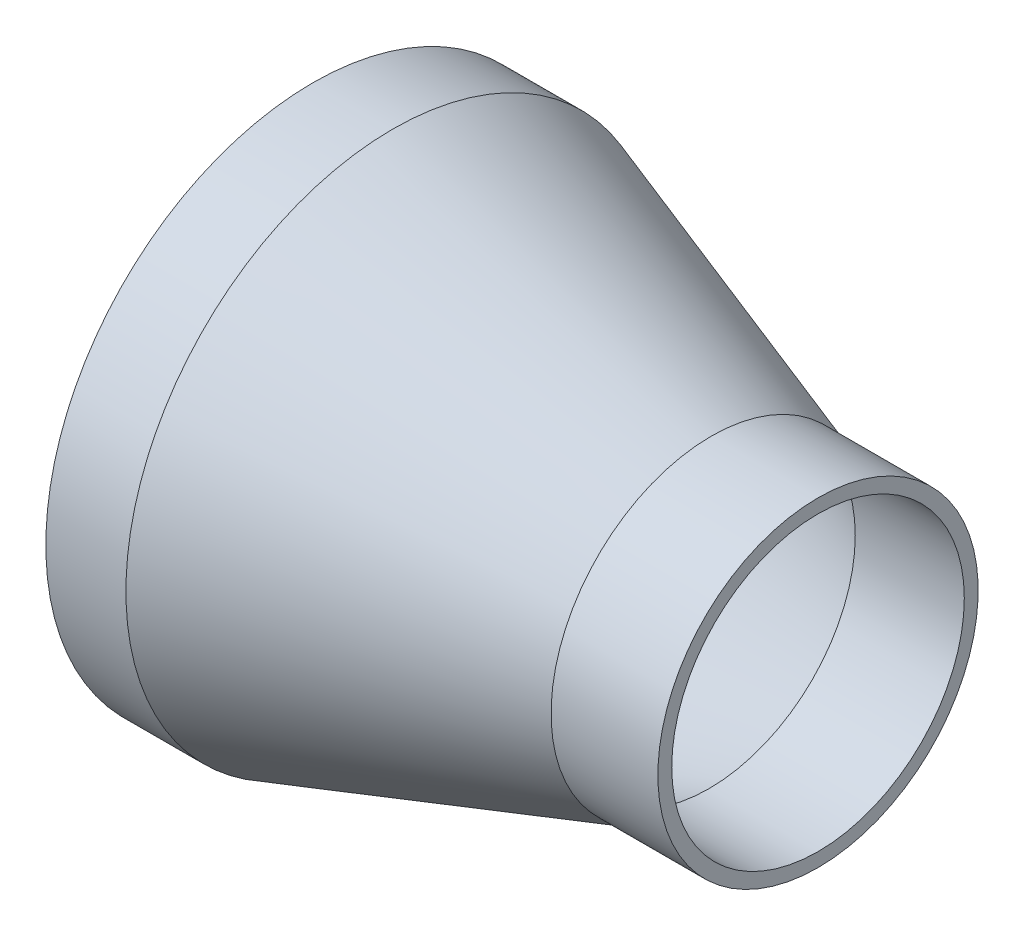
ISO-10303-21;
HEADER;
FILE_DESCRIPTION(('STEP AP214'),'2;1');
FILE_NAME('part.step','',(''),(''),'','','');
FILE_SCHEMA(('AUTOMOTIVE_DESIGN { 1 0 10303 214 1 1 1 1 }'));
ENDSEC;
DATA;
#1=APPLICATION_CONTEXT('core data for automotive mechanical design processes');
#2=APPLICATION_PROTOCOL_DEFINITION('international standard','automotive_design',2000,#1);
#3=PRODUCT_CONTEXT('',#1,'mechanical');
#4=PRODUCT('Part','Part','',(#3));
#5=PRODUCT_RELATED_PRODUCT_CATEGORY('part','',(#4));
#6=PRODUCT_DEFINITION_FORMATION('','',#4);
#7=PRODUCT_DEFINITION_CONTEXT('part definition',#1,'design');
#8=PRODUCT_DEFINITION('design','',#6,#7);
#9=PRODUCT_DEFINITION_SHAPE('','',#8);
#10=(LENGTH_UNIT() NAMED_UNIT(*) SI_UNIT(.MILLI.,.METRE.));
#11=(NAMED_UNIT(*) PLANE_ANGLE_UNIT() SI_UNIT($,.RADIAN.));
#12=(NAMED_UNIT(*) SI_UNIT($,.STERADIAN.) SOLID_ANGLE_UNIT());
#13=UNCERTAINTY_MEASURE_WITH_UNIT(LENGTH_MEASURE(1.E-05),#10,'distance_accuracy_value','');
#14=(GEOMETRIC_REPRESENTATION_CONTEXT(3) GLOBAL_UNCERTAINTY_ASSIGNED_CONTEXT((#13)) GLOBAL_UNIT_ASSIGNED_CONTEXT((#10,
#11,#12)) REPRESENTATION_CONTEXT('',''));
#15=CARTESIAN_POINT('',(0.,0.,0.));
#16=DIRECTION('',(0.,0.,1.));
#17=DIRECTION('',(1.,0.,0.));
#18=AXIS2_PLACEMENT_3D('',#15,#16,#17);
#19=CARTESIAN_POINT('',(9.25554604716234,0.,0.));
#20=DIRECTION('',(-1.,0.,0.));
#21=DIRECTION('',(0.,-1.,0.));
#22=AXIS2_PLACEMENT_3D('',#19,#20,#21);
#23=CONICAL_SURFACE('',#22,30.0989999929991,0.323560324824038);
#24=CARTESIAN_POINT('',(47.1269460495131,0.,0.));
#25=DIRECTION('',(1.,0.,0.));
#26=DIRECTION('',(0.,1.,0.));
#27=AXIS2_PLACEMENT_3D('',#24,#25,#26);
#28=CIRCLE('',#27,17.399);
#29=CARTESIAN_POINT('',(47.1269460495131,17.399,0.));
#30=VERTEX_POINT('',#29);
#31=EDGE_CURVE('E36',#30,#30,#28,.T.);
#32=ORIENTED_EDGE('',*,*,#31,.T.);
#33=EDGE_LOOP('',(#32));
#34=FACE_BOUND('',#33,.T.);
#35=CARTESIAN_POINT('',(9.2555460495101,0.,0.));
#36=DIRECTION('',(1.,0.,0.));
#37=DIRECTION('',(0.,1.,0.));
#38=AXIS2_PLACEMENT_3D('',#35,#36,#37);
#39=CIRCLE('',#38,30.099);
#40=CARTESIAN_POINT('',(9.2555460495101,30.099,0.));
#41=VERTEX_POINT('',#40);
#42=EDGE_CURVE('E33',#41,#41,#39,.F.);
#43=ORIENTED_EDGE('',*,*,#42,.T.);
#44=EDGE_LOOP('',(#43));
#45=FACE_BOUND('',#44,.T.);
#46=ADVANCED_FACE('F14',(#34,#45),#23,.F.);
#47=CARTESIAN_POINT('',(53.6116730247583,0.,0.));
#48=DIRECTION('',(1.,0.,0.));
#49=DIRECTION('',(0.,1.,0.));
#50=AXIS2_PLACEMENT_3D('',#47,#48,#49);
#51=CYLINDRICAL_SURFACE('',#50,17.399);
#52=CARTESIAN_POINT('',(60.0964000000034,0.,0.));
#53=DIRECTION('',(1.,0.,0.));
#54=DIRECTION('',(0.,1.,0.));
#55=AXIS2_PLACEMENT_3D('',#52,#53,#54);
#56=CIRCLE('',#55,17.399);
#57=CARTESIAN_POINT('',(60.0964000000034,17.399,0.));
#58=VERTEX_POINT('',#57);
#59=EDGE_CURVE('E17',#58,#58,#56,.F.);
#60=ORIENTED_EDGE('',*,*,#59,.F.);
#61=EDGE_LOOP('',(#60));
#62=FACE_BOUND('',#61,.T.);
#63=ORIENTED_EDGE('',*,*,#31,.F.);
#64=EDGE_LOOP('',(#63));
#65=FACE_BOUND('',#64,.T.);
#66=ADVANCED_FACE('F57',(#62,#65),#51,.F.);
#67=CARTESIAN_POINT('',(4.62777302475505,0.,0.));
#68=DIRECTION('',(1.,0.,0.));
#69=DIRECTION('',(0.,1.,0.));
#70=AXIS2_PLACEMENT_3D('',#67,#68,#69);
#71=CYLINDRICAL_SURFACE('',#70,30.099);
#72=ORIENTED_EDGE('',*,*,#42,.F.);
#73=EDGE_LOOP('',(#72));
#74=FACE_BOUND('',#73,.T.);
#75=CARTESIAN_POINT('',(0.,0.,0.));
#76=DIRECTION('',(1.,0.,0.));
#77=DIRECTION('',(0.,1.,0.));
#78=AXIS2_PLACEMENT_3D('',#75,#76,#77);
#79=CIRCLE('',#78,30.099);
#80=CARTESIAN_POINT('',(0.,30.099,0.));
#81=VERTEX_POINT('',#80);
#82=EDGE_CURVE('E47',#81,#81,#79,.T.);
#83=ORIENTED_EDGE('',*,*,#82,.F.);
#84=EDGE_LOOP('',(#83));
#85=FACE_BOUND('',#84,.T.);
#86=ADVANCED_FACE('F60',(#74,#85),#71,.F.);
#87=CARTESIAN_POINT('',(60.0964000000034,18.2245,0.));
#88=DIRECTION('',(1.,0.,0.));
#89=DIRECTION('',(0.,0.,-1.));
#90=AXIS2_PLACEMENT_3D('',#87,#88,#89);
#91=PLANE('',#90);
#92=ORIENTED_EDGE('',*,*,#59,.T.);
#93=EDGE_LOOP('',(#92));
#94=FACE_BOUND('',#93,.T.);
#95=CARTESIAN_POINT('',(60.0964000000034,0.,0.));
#96=DIRECTION('',(1.,0.,0.));
#97=DIRECTION('',(0.,1.,0.));
#98=AXIS2_PLACEMENT_3D('',#95,#96,#97);
#99=CIRCLE('',#98,19.05);
#100=CARTESIAN_POINT('',(60.0964000000034,19.05,0.));
#101=VERTEX_POINT('',#100);
#102=EDGE_CURVE('E45',#101,#101,#99,.F.);
#103=ORIENTED_EDGE('',*,*,#102,.F.);
#104=EDGE_LOOP('',(#103));
#105=FACE_BOUND('',#104,.T.);
#106=ADVANCED_FACE('F54',(#94,#105),#91,.T.);
#107=CARTESIAN_POINT('',(0.,30.9245,0.));
#108=DIRECTION('',(-1.,0.,0.));
#109=DIRECTION('',(0.,0.,1.));
#110=AXIS2_PLACEMENT_3D('',#107,#108,#109);
#111=PLANE('',#110);
#112=ORIENTED_EDGE('',*,*,#82,.T.);
#113=EDGE_LOOP('',(#112));
#114=FACE_BOUND('',#113,.T.);
#115=CARTESIAN_POINT('',(0.,0.,0.));
#116=DIRECTION('',(1.,0.,0.));
#117=DIRECTION('',(0.,1.,0.));
#118=AXIS2_PLACEMENT_3D('',#115,#116,#117);
#119=CIRCLE('',#118,31.75);
#120=CARTESIAN_POINT('',(0.,31.75,0.));
#121=VERTEX_POINT('',#120);
#122=EDGE_CURVE('E26',#121,#121,#119,.T.);
#123=ORIENTED_EDGE('',*,*,#122,.F.);
#124=EDGE_LOOP('',(#123));
#125=FACE_BOUND('',#124,.T.);
#126=ADVANCED_FACE('F74',(#114,#125),#111,.T.);
#127=CARTESIAN_POINT('',(53.7464000000034,0.,0.));
#128=DIRECTION('',(1.,0.,0.));
#129=DIRECTION('',(0.,1.,0.));
#130=AXIS2_PLACEMENT_3D('',#127,#128,#129);
#131=CYLINDRICAL_SURFACE('',#130,19.05);
#132=CARTESIAN_POINT('',(47.3964000023511,0.,0.));
#133=DIRECTION('',(-1.,0.,0.));
#134=DIRECTION('',(0.,1.,0.));
#135=AXIS2_PLACEMENT_3D('',#132,#133,#134);
#136=CIRCLE('',#135,19.050000007001);
#137=CARTESIAN_POINT('',(47.3964000023511,19.050000007001,0.));
#138=VERTEX_POINT('',#137);
#139=EDGE_CURVE('E21',#138,#138,#136,.T.);
#140=ORIENTED_EDGE('',*,*,#139,.F.);
#141=EDGE_LOOP('',(#140));
#142=FACE_BOUND('',#141,.T.);
#143=ORIENTED_EDGE('',*,*,#102,.T.);
#144=EDGE_LOOP('',(#143));
#145=FACE_BOUND('',#144,.T.);
#146=ADVANCED_FACE('F83',(#142,#145),#131,.T.);
#147=CARTESIAN_POINT('',(4.76250000000018,0.,0.));
#148=DIRECTION('',(1.,0.,0.));
#149=DIRECTION('',(0.,1.,0.));
#150=AXIS2_PLACEMENT_3D('',#147,#148,#149);
#151=CYLINDRICAL_SURFACE('',#150,31.75);
#152=ORIENTED_EDGE('',*,*,#122,.T.);
#153=EDGE_LOOP('',(#152));
#154=FACE_BOUND('',#153,.T.);
#155=CARTESIAN_POINT('',(9.52499999765262,0.,0.));
#156=DIRECTION('',(-1.,0.,0.));
#157=DIRECTION('',(0.,1.,0.));
#158=AXIS2_PLACEMENT_3D('',#155,#156,#157);
#159=CIRCLE('',#158,31.7499999929991);
#160=CARTESIAN_POINT('',(9.52499999765262,31.7499999929991,0.));
#161=VERTEX_POINT('',#160);
#162=EDGE_CURVE('E10',#161,#161,#159,.F.);
#163=ORIENTED_EDGE('',*,*,#162,.F.);
#164=EDGE_LOOP('',(#163));
#165=FACE_BOUND('',#164,.T.);
#166=ADVANCED_FACE('F78',(#154,#165),#151,.T.);
#167=CARTESIAN_POINT('',(9.52499999765262,0.,0.));
#168=DIRECTION('',(-1.,0.,0.));
#169=DIRECTION('',(0.,-1.,0.));
#170=AXIS2_PLACEMENT_3D('',#167,#168,#169);
#171=CONICAL_SURFACE('',#170,31.7499999929991,0.323560324824038);
#172=ORIENTED_EDGE('',*,*,#162,.T.);
#173=EDGE_LOOP('',(#172));
#174=FACE_BOUND('',#173,.T.);
#175=ORIENTED_EDGE('',*,*,#139,.T.);
#176=EDGE_LOOP('',(#175));
#177=FACE_BOUND('',#176,.T.);
#178=ADVANCED_FACE('F76',(#174,#177),#171,.T.);
#179=CLOSED_SHELL('',(#46,#66,#86,#106,#126,#146,#166,#178));
#180=MANIFOLD_SOLID_BREP('B1',#179);
#181=ADVANCED_BREP_SHAPE_REPRESENTATION('',(#18,#180),#14);
#182=SHAPE_DEFINITION_REPRESENTATION(#9,#181);
ENDSEC;
END-ISO-10303-21;
